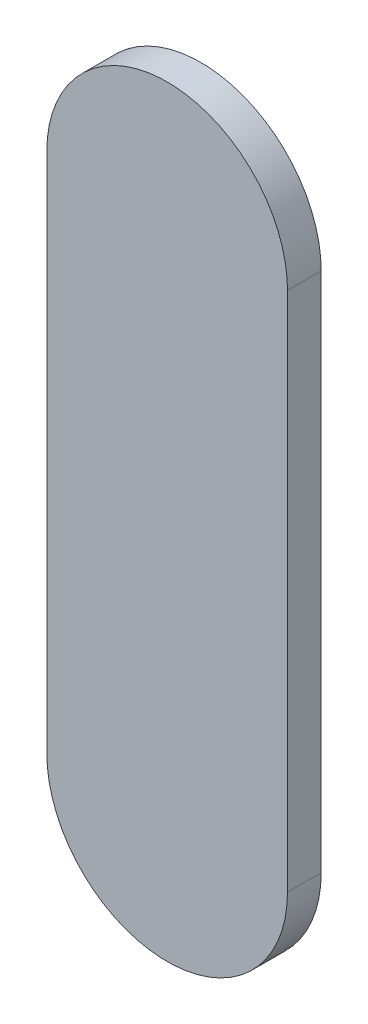
ISO-10303-21;
HEADER;
FILE_DESCRIPTION(('STEP AP214'),'2;1');
FILE_NAME('part.step','',(''),(''),'','','');
FILE_SCHEMA(('AUTOMOTIVE_DESIGN { 1 0 10303 214 1 1 1 1 }'));
ENDSEC;
DATA;
#1=APPLICATION_CONTEXT('core data for automotive mechanical design processes');
#2=APPLICATION_PROTOCOL_DEFINITION('international standard','automotive_design',2000,#1);
#3=PRODUCT_CONTEXT('',#1,'mechanical');
#4=PRODUCT('Part','Part','',(#3));
#5=PRODUCT_RELATED_PRODUCT_CATEGORY('part','',(#4));
#6=PRODUCT_DEFINITION_FORMATION('','',#4);
#7=PRODUCT_DEFINITION_CONTEXT('part definition',#1,'design');
#8=PRODUCT_DEFINITION('design','',#6,#7);
#9=PRODUCT_DEFINITION_SHAPE('','',#8);
#10=(LENGTH_UNIT() NAMED_UNIT(*) SI_UNIT(.MILLI.,.METRE.));
#11=(NAMED_UNIT(*) PLANE_ANGLE_UNIT() SI_UNIT($,.RADIAN.));
#12=(NAMED_UNIT(*) SI_UNIT($,.STERADIAN.) SOLID_ANGLE_UNIT());
#13=UNCERTAINTY_MEASURE_WITH_UNIT(LENGTH_MEASURE(1.E-05),#10,'distance_accuracy_value','');
#14=(GEOMETRIC_REPRESENTATION_CONTEXT(3) GLOBAL_UNCERTAINTY_ASSIGNED_CONTEXT((#13)) GLOBAL_UNIT_ASSIGNED_CONTEXT((#10,
#11,#12)) REPRESENTATION_CONTEXT('',''));
#15=CARTESIAN_POINT('',(0.,0.,0.));
#16=DIRECTION('',(0.,0.,1.));
#17=DIRECTION('',(1.,0.,0.));
#18=AXIS2_PLACEMENT_3D('',#15,#16,#17);
#19=CARTESIAN_POINT('',(96.4939904,85.13695444,0.));
#20=DIRECTION('',(-1.,0.,0.));
#21=DIRECTION('',(0.,1.,0.));
#22=AXIS2_PLACEMENT_3D('',#19,#20,#21);
#23=PLANE('',#22);
#24=DIRECTION('',(0.,1.,0.));
#25=VECTOR('',#24,1.);
#26=CARTESIAN_POINT('',(96.4939904,85.13695444,0.03556));
#27=LINE('',#26,#25);
#28=CARTESIAN_POINT('',(96.4939904,85.13695444,0.03556));
#29=VERTEX_POINT('',#28);
#30=CARTESIAN_POINT('',(96.4939904,85.6869508,0.03556));
#31=VERTEX_POINT('',#30);
#32=EDGE_CURVE('E11',#29,#31,#27,.T.);
#33=ORIENTED_EDGE('',*,*,#32,.F.);
#34=DIRECTION('',(0.,0.,1.));
#35=VECTOR('',#34,1.);
#36=CARTESIAN_POINT('',(96.4939904,85.13695444,0.));
#37=LINE('',#36,#35);
#38=CARTESIAN_POINT('',(96.4939904,85.13695444,0.));
#39=VERTEX_POINT('',#38);
#40=EDGE_CURVE('E24',#39,#29,#37,.T.);
#41=ORIENTED_EDGE('',*,*,#40,.F.);
#42=DIRECTION('',(0.,1.,0.));
#43=VECTOR('',#42,1.);
#44=CARTESIAN_POINT('',(96.4939904,85.13695444,0.));
#45=LINE('',#44,#43);
#46=CARTESIAN_POINT('',(96.4939904,85.6869508,0.));
#47=VERTEX_POINT('',#46);
#48=EDGE_CURVE('E75',#39,#47,#45,.T.);
#49=ORIENTED_EDGE('',*,*,#48,.T.);
#50=DIRECTION('',(0.,0.,1.));
#51=VECTOR('',#50,1.);
#52=CARTESIAN_POINT('',(96.4939904,85.6869508,0.));
#53=LINE('',#52,#51);
#54=EDGE_CURVE('E37',#47,#31,#53,.T.);
#55=ORIENTED_EDGE('',*,*,#54,.T.);
#56=EDGE_LOOP('',(#33,#41,#49,#55));
#57=FACE_BOUND('',#56,.T.);
#58=ADVANCED_FACE('F17',(#57),#23,.F.);
#59=CARTESIAN_POINT('',(96.3669904,85.6869508,0.));
#60=DIRECTION('',(0.,0.,-1.));
#61=DIRECTION('',(1.,1.1189649382048E-13,0.));
#62=AXIS2_PLACEMENT_3D('',#59,#60,#61);
#63=CYLINDRICAL_SURFACE('',#62,0.127000000000005);
#64=CARTESIAN_POINT('',(96.3669904,85.6869508,0.03556));
#65=DIRECTION('',(0.,0.,1.));
#66=DIRECTION('',(1.,1.1189649382048E-13,0.));
#67=AXIS2_PLACEMENT_3D('',#64,#65,#66);
#68=CIRCLE('',#67,0.127000000000005);
#69=CARTESIAN_POINT('',(96.2399904,85.6869508,0.03556));
#70=VERTEX_POINT('',#69);
#71=EDGE_CURVE('E83',#31,#70,#68,.T.);
#72=ORIENTED_EDGE('',*,*,#71,.F.);
#73=ORIENTED_EDGE('',*,*,#54,.F.);
#74=CARTESIAN_POINT('',(96.3669904,85.6869508,0.));
#75=DIRECTION('',(0.,0.,1.));
#76=DIRECTION('',(1.,1.1189649382048E-13,0.));
#77=AXIS2_PLACEMENT_3D('',#74,#75,#76);
#78=CIRCLE('',#77,0.127000000000005);
#79=CARTESIAN_POINT('',(96.2399904,85.6869508,0.));
#80=VERTEX_POINT('',#79);
#81=EDGE_CURVE('E81',#47,#80,#78,.T.);
#82=ORIENTED_EDGE('',*,*,#81,.T.);
#83=DIRECTION('',(0.,0.,1.));
#84=VECTOR('',#83,1.);
#85=CARTESIAN_POINT('',(96.2399904,85.6869508,0.));
#86=LINE('',#85,#84);
#87=EDGE_CURVE('E67',#80,#70,#86,.T.);
#88=ORIENTED_EDGE('',*,*,#87,.T.);
#89=EDGE_LOOP('',(#72,#73,#82,#88));
#90=FACE_BOUND('',#89,.T.);
#91=ADVANCED_FACE('F89',(#90),#63,.T.);
#92=CARTESIAN_POINT('',(96.2399904,85.6869508,0.));
#93=DIRECTION('',(1.,0.,0.));
#94=DIRECTION('',(0.,-1.,0.));
#95=AXIS2_PLACEMENT_3D('',#92,#93,#94);
#96=PLANE('',#95);
#97=DIRECTION('',(0.,-1.,0.));
#98=VECTOR('',#97,1.);
#99=CARTESIAN_POINT('',(96.2399904,85.6869508,0.03556));
#100=LINE('',#99,#98);
#101=CARTESIAN_POINT('',(96.2399904,85.13695444,0.03556));
#102=VERTEX_POINT('',#101);
#103=EDGE_CURVE('E71',#70,#102,#100,.T.);
#104=ORIENTED_EDGE('',*,*,#103,.F.);
#105=ORIENTED_EDGE('',*,*,#87,.F.);
#106=DIRECTION('',(0.,-1.,0.));
#107=VECTOR('',#106,1.);
#108=CARTESIAN_POINT('',(96.2399904,85.6869508,0.));
#109=LINE('',#108,#107);
#110=CARTESIAN_POINT('',(96.2399904,85.13695444,0.));
#111=VERTEX_POINT('',#110);
#112=EDGE_CURVE('E63',#80,#111,#109,.T.);
#113=ORIENTED_EDGE('',*,*,#112,.T.);
#114=DIRECTION('',(0.,0.,1.));
#115=VECTOR('',#114,1.);
#116=CARTESIAN_POINT('',(96.2399904,85.13695444,0.));
#117=LINE('',#116,#115);
#118=EDGE_CURVE('E53',#111,#102,#117,.T.);
#119=ORIENTED_EDGE('',*,*,#118,.T.);
#120=EDGE_LOOP('',(#104,#105,#113,#119));
#121=FACE_BOUND('',#120,.T.);
#122=ADVANCED_FACE('F66',(#121),#96,.F.);
#123=CARTESIAN_POINT('',(96.3669904,85.13695444,0.));
#124=DIRECTION('',(0.,0.,-1.));
#125=DIRECTION('',(-1.,-1.11896493820492E-13,0.));
#126=AXIS2_PLACEMENT_3D('',#123,#124,#125);
#127=CYLINDRICAL_SURFACE('',#126,0.127000000000005);
#128=CARTESIAN_POINT('',(96.3669904,85.13695444,0.03556));
#129=DIRECTION('',(0.,0.,1.));
#130=DIRECTION('',(-1.,-1.11896493820492E-13,0.));
#131=AXIS2_PLACEMENT_3D('',#128,#129,#130);
#132=CIRCLE('',#131,0.127000000000005);
#133=EDGE_CURVE('E59',#102,#29,#132,.T.);
#134=ORIENTED_EDGE('',*,*,#133,.F.);
#135=ORIENTED_EDGE('',*,*,#118,.F.);
#136=CARTESIAN_POINT('',(96.3669904,85.13695444,0.));
#137=DIRECTION('',(0.,0.,1.));
#138=DIRECTION('',(-1.,-1.11896493820492E-13,0.));
#139=AXIS2_PLACEMENT_3D('',#136,#137,#138);
#140=CIRCLE('',#139,0.127000000000005);
#141=EDGE_CURVE('E57',#111,#39,#140,.T.);
#142=ORIENTED_EDGE('',*,*,#141,.T.);
#143=ORIENTED_EDGE('',*,*,#40,.T.);
#144=EDGE_LOOP('',(#134,#135,#142,#143));
#145=FACE_BOUND('',#144,.T.);
#146=ADVANCED_FACE('F55',(#145),#127,.T.);
#147=CARTESIAN_POINT('',(96.4939904,85.13695444,0.));
#148=DIRECTION('',(0.,0.,-1.));
#149=DIRECTION('',(-1.,0.,0.));
#150=AXIS2_PLACEMENT_3D('',#147,#148,#149);
#151=PLANE('',#150);
#152=ORIENTED_EDGE('',*,*,#141,.F.);
#153=ORIENTED_EDGE('',*,*,#112,.F.);
#154=ORIENTED_EDGE('',*,*,#81,.F.);
#155=ORIENTED_EDGE('',*,*,#48,.F.);
#156=EDGE_LOOP('',(#152,#153,#154,#155));
#157=FACE_BOUND('',#156,.T.);
#158=ADVANCED_FACE('F74',(#157),#151,.T.);
#159=CARTESIAN_POINT('',(96.4939904,85.13695444,0.03556));
#160=DIRECTION('',(0.,0.,-1.));
#161=DIRECTION('',(-1.,0.,0.));
#162=AXIS2_PLACEMENT_3D('',#159,#160,#161);
#163=PLANE('',#162);
#164=ORIENTED_EDGE('',*,*,#32,.T.);
#165=ORIENTED_EDGE('',*,*,#71,.T.);
#166=ORIENTED_EDGE('',*,*,#103,.T.);
#167=ORIENTED_EDGE('',*,*,#133,.T.);
#168=EDGE_LOOP('',(#164,#165,#166,#167));
#169=FACE_BOUND('',#168,.T.);
#170=ADVANCED_FACE('F91',(#169),#163,.F.);
#171=CLOSED_SHELL('',(#58,#91,#122,#146,#158,#170));
#172=MANIFOLD_SOLID_BREP('B1',#171);
#173=ADVANCED_BREP_SHAPE_REPRESENTATION('',(#18,#172),#14);
#174=SHAPE_DEFINITION_REPRESENTATION(#9,#173);
ENDSEC;
END-ISO-10303-21;
